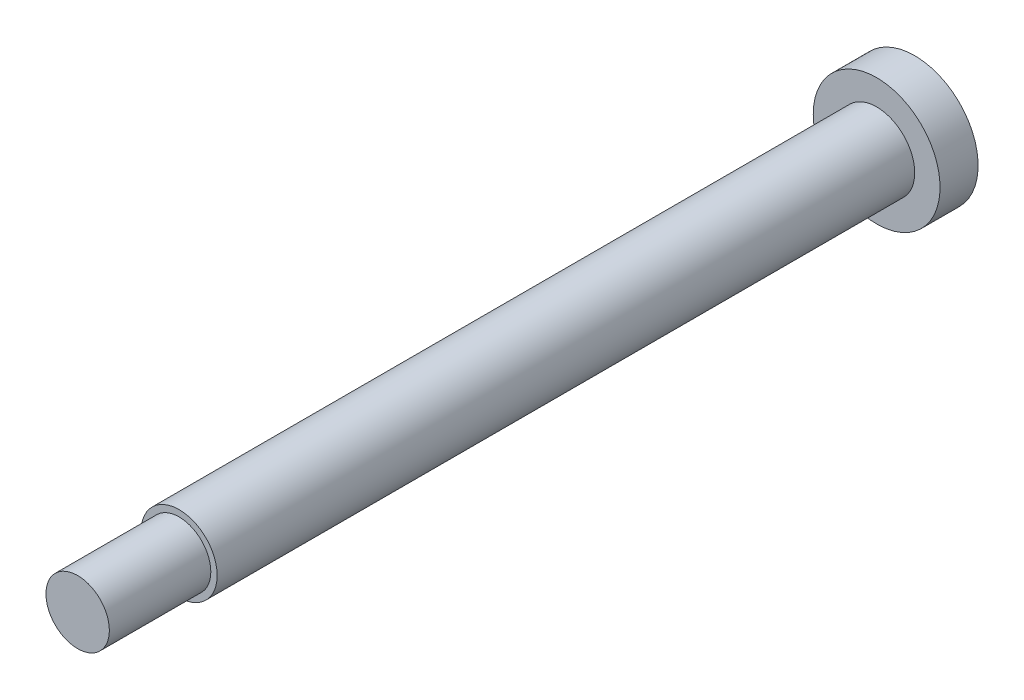
ISO-10303-21;
HEADER;
FILE_DESCRIPTION(('STEP AP214'),'2;1');
FILE_NAME('part.step','',(''),(''),'','','');
FILE_SCHEMA(('AUTOMOTIVE_DESIGN { 1 0 10303 214 1 1 1 1 }'));
ENDSEC;
DATA;
#1=APPLICATION_CONTEXT('core data for automotive mechanical design processes');
#2=APPLICATION_PROTOCOL_DEFINITION('international standard','automotive_design',2000,#1);
#3=PRODUCT_CONTEXT('',#1,'mechanical');
#4=PRODUCT('Part','Part','',(#3));
#5=PRODUCT_RELATED_PRODUCT_CATEGORY('part','',(#4));
#6=PRODUCT_DEFINITION_FORMATION('','',#4);
#7=PRODUCT_DEFINITION_CONTEXT('part definition',#1,'design');
#8=PRODUCT_DEFINITION('design','',#6,#7);
#9=PRODUCT_DEFINITION_SHAPE('','',#8);
#10=(LENGTH_UNIT() NAMED_UNIT(*) SI_UNIT(.MILLI.,.METRE.));
#11=(NAMED_UNIT(*) PLANE_ANGLE_UNIT() SI_UNIT($,.RADIAN.));
#12=(NAMED_UNIT(*) SI_UNIT($,.STERADIAN.) SOLID_ANGLE_UNIT());
#13=UNCERTAINTY_MEASURE_WITH_UNIT(LENGTH_MEASURE(1.E-05),#10,'distance_accuracy_value','');
#14=(GEOMETRIC_REPRESENTATION_CONTEXT(3) GLOBAL_UNCERTAINTY_ASSIGNED_CONTEXT((#13)) GLOBAL_UNIT_ASSIGNED_CONTEXT((#10,
#11,#12)) REPRESENTATION_CONTEXT('',''));
#15=CARTESIAN_POINT('',(0.,0.,0.));
#16=DIRECTION('',(0.,0.,1.));
#17=DIRECTION('',(1.,0.,0.));
#18=AXIS2_PLACEMENT_3D('',#15,#16,#17);
#19=CARTESIAN_POINT('',(0.,0.,55.));
#20=DIRECTION('',(0.,0.,-1.));
#21=DIRECTION('',(-1.,0.,0.));
#22=AXIS2_PLACEMENT_3D('',#19,#20,#21);
#23=CYLINDRICAL_SURFACE('',#22,3.);
#24=CARTESIAN_POINT('',(0.,0.,55.));
#25=DIRECTION('',(0.,0.,1.));
#26=DIRECTION('',(1.,0.,0.));
#27=AXIS2_PLACEMENT_3D('',#24,#25,#26);
#28=CIRCLE('',#27,3.);
#29=CARTESIAN_POINT('',(3.,0.,55.));
#30=VERTEX_POINT('',#29);
#31=EDGE_CURVE('E43',#30,#30,#28,.T.);
#32=ORIENTED_EDGE('',*,*,#31,.F.);
#33=EDGE_LOOP('',(#32));
#34=FACE_BOUND('',#33,.T.);
#35=CARTESIAN_POINT('',(0.,0.,0.));
#36=DIRECTION('',(0.,0.,1.));
#37=DIRECTION('',(1.,0.,0.));
#38=AXIS2_PLACEMENT_3D('',#35,#36,#37);
#39=CIRCLE('',#38,3.);
#40=CARTESIAN_POINT('',(3.,0.,0.));
#41=VERTEX_POINT('',#40);
#42=EDGE_CURVE('E39',#41,#41,#39,.T.);
#43=ORIENTED_EDGE('',*,*,#42,.T.);
#44=EDGE_LOOP('',(#43));
#45=FACE_BOUND('',#44,.T.);
#46=ADVANCED_FACE('F36',(#34,#45),#23,.T.);
#47=CARTESIAN_POINT('',(0.,0.,55.));
#48=DIRECTION('',(0.,0.,1.));
#49=DIRECTION('',(1.,0.,0.));
#50=AXIS2_PLACEMENT_3D('',#47,#48,#49);
#51=PLANE('',#50);
#52=CARTESIAN_POINT('',(0.,0.,55.));
#53=DIRECTION('',(0.,0.,1.));
#54=DIRECTION('',(1.,0.,0.));
#55=AXIS2_PLACEMENT_3D('',#52,#53,#54);
#56=CIRCLE('',#55,2.5);
#57=CARTESIAN_POINT('',(2.5,0.,55.));
#58=VERTEX_POINT('',#57);
#59=EDGE_CURVE('E10',#58,#58,#56,.T.);
#60=ORIENTED_EDGE('',*,*,#59,.F.);
#61=EDGE_LOOP('',(#60));
#62=FACE_BOUND('',#61,.T.);
#63=ORIENTED_EDGE('',*,*,#31,.T.);
#64=EDGE_LOOP('',(#63));
#65=FACE_BOUND('',#64,.T.);
#66=ADVANCED_FACE('F84',(#62,#65),#51,.T.);
#67=CARTESIAN_POINT('',(0.,0.,63.));
#68=DIRECTION('',(0.,0.,-1.));
#69=DIRECTION('',(-1.,0.,0.));
#70=AXIS2_PLACEMENT_3D('',#67,#68,#69);
#71=CYLINDRICAL_SURFACE('',#70,2.5);
#72=CARTESIAN_POINT('',(0.,0.,63.));
#73=DIRECTION('',(0.,0.,1.));
#74=DIRECTION('',(1.,0.,0.));
#75=AXIS2_PLACEMENT_3D('',#72,#73,#74);
#76=CIRCLE('',#75,2.5);
#77=CARTESIAN_POINT('',(2.5,0.,63.));
#78=VERTEX_POINT('',#77);
#79=EDGE_CURVE('E48',#78,#78,#76,.T.);
#80=ORIENTED_EDGE('',*,*,#79,.F.);
#81=EDGE_LOOP('',(#80));
#82=FACE_BOUND('',#81,.T.);
#83=ORIENTED_EDGE('',*,*,#59,.T.);
#84=EDGE_LOOP('',(#83));
#85=FACE_BOUND('',#84,.T.);
#86=ADVANCED_FACE('F80',(#82,#85),#71,.T.);
#87=CARTESIAN_POINT('',(0.,0.,63.));
#88=DIRECTION('',(0.,0.,1.));
#89=DIRECTION('',(1.,0.,0.));
#90=AXIS2_PLACEMENT_3D('',#87,#88,#89);
#91=PLANE('',#90);
#92=ORIENTED_EDGE('',*,*,#79,.T.);
#93=EDGE_LOOP('',(#92));
#94=FACE_BOUND('',#93,.T.);
#95=ADVANCED_FACE('F72',(#94),#91,.T.);
#96=CARTESIAN_POINT('',(0.,0.,-3.));
#97=DIRECTION('',(0.,0.,1.));
#98=DIRECTION('',(1.,0.,0.));
#99=AXIS2_PLACEMENT_3D('',#96,#97,#98);
#100=CYLINDRICAL_SURFACE('',#99,5.);
#101=CARTESIAN_POINT('',(0.,0.,-3.));
#102=DIRECTION('',(0.,0.,-1.));
#103=DIRECTION('',(-1.,0.,0.));
#104=AXIS2_PLACEMENT_3D('',#101,#102,#103);
#105=CIRCLE('',#104,5.);
#106=CARTESIAN_POINT('',(-5.,0.,-3.));
#107=VERTEX_POINT('',#106);
#108=EDGE_CURVE('E55',#107,#107,#105,.T.);
#109=ORIENTED_EDGE('',*,*,#108,.F.);
#110=EDGE_LOOP('',(#109));
#111=FACE_BOUND('',#110,.T.);
#112=CARTESIAN_POINT('',(0.,0.,0.));
#113=DIRECTION('',(0.,0.,-1.));
#114=DIRECTION('',(-1.,0.,0.));
#115=AXIS2_PLACEMENT_3D('',#112,#113,#114);
#116=CIRCLE('',#115,5.);
#117=CARTESIAN_POINT('',(-5.,0.,0.));
#118=VERTEX_POINT('',#117);
#119=EDGE_CURVE('E52',#118,#118,#116,.T.);
#120=ORIENTED_EDGE('',*,*,#119,.T.);
#121=EDGE_LOOP('',(#120));
#122=FACE_BOUND('',#121,.T.);
#123=ADVANCED_FACE('F70',(#111,#122),#100,.T.);
#124=CARTESIAN_POINT('',(0.,0.,-3.));
#125=DIRECTION('',(0.,0.,-1.));
#126=DIRECTION('',(-1.,0.,0.));
#127=AXIS2_PLACEMENT_3D('',#124,#125,#126);
#128=PLANE('',#127);
#129=ORIENTED_EDGE('',*,*,#108,.T.);
#130=EDGE_LOOP('',(#129));
#131=FACE_BOUND('',#130,.T.);
#132=ADVANCED_FACE('F66',(#131),#128,.T.);
#133=CARTESIAN_POINT('',(0.,0.,0.));
#134=DIRECTION('',(0.,0.,-1.));
#135=DIRECTION('',(-1.,0.,0.));
#136=AXIS2_PLACEMENT_3D('',#133,#134,#135);
#137=PLANE('',#136);
#138=ORIENTED_EDGE('',*,*,#42,.F.);
#139=EDGE_LOOP('',(#138));
#140=FACE_BOUND('',#139,.T.);
#141=ORIENTED_EDGE('',*,*,#119,.F.);
#142=EDGE_LOOP('',(#141));
#143=FACE_BOUND('',#142,.T.);
#144=ADVANCED_FACE('F63',(#140,#143),#137,.F.);
#145=CLOSED_SHELL('',(#46,#66,#86,#95,#123,#132,#144));
#146=MANIFOLD_SOLID_BREP('B2',#145);
#147=ADVANCED_BREP_SHAPE_REPRESENTATION('',(#18,#146),#14);
#148=SHAPE_DEFINITION_REPRESENTATION(#9,#147);
ENDSEC;
END-ISO-10303-21;
